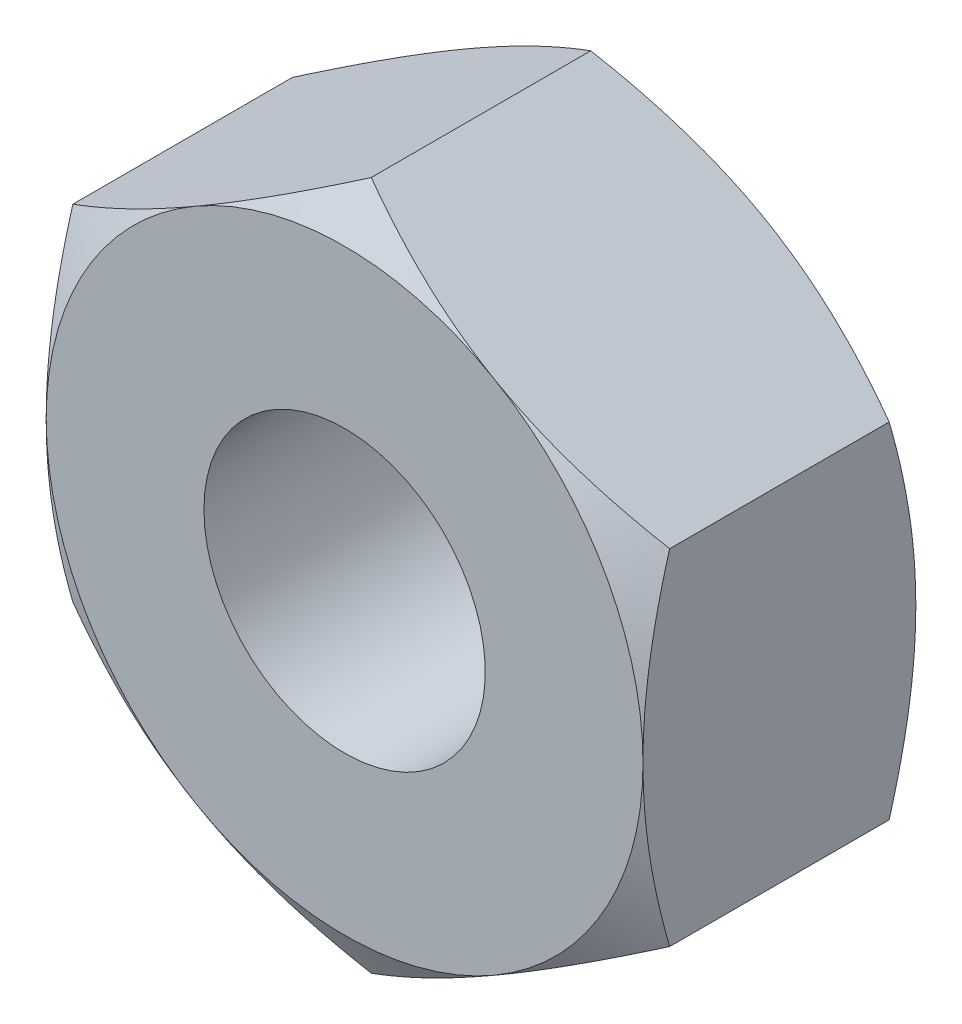
ISO-10303-21;
HEADER;
FILE_DESCRIPTION(('STEP AP214'),'2;1');
FILE_NAME('part.step','',(''),(''),'','','');
FILE_SCHEMA(('AUTOMOTIVE_DESIGN { 1 0 10303 214 1 1 1 1 }'));
ENDSEC;
DATA;
#1=APPLICATION_CONTEXT('core data for automotive mechanical design processes');
#2=APPLICATION_PROTOCOL_DEFINITION('international standard','automotive_design',2000,#1);
#3=PRODUCT_CONTEXT('',#1,'mechanical');
#4=PRODUCT('Part','Part','',(#3));
#5=PRODUCT_RELATED_PRODUCT_CATEGORY('part','',(#4));
#6=PRODUCT_DEFINITION_FORMATION('','',#4);
#7=PRODUCT_DEFINITION_CONTEXT('part definition',#1,'design');
#8=PRODUCT_DEFINITION('design','',#6,#7);
#9=PRODUCT_DEFINITION_SHAPE('','',#8);
#10=(LENGTH_UNIT() NAMED_UNIT(*) SI_UNIT(.MILLI.,.METRE.));
#11=(NAMED_UNIT(*) PLANE_ANGLE_UNIT() SI_UNIT($,.RADIAN.));
#12=(NAMED_UNIT(*) SI_UNIT($,.STERADIAN.) SOLID_ANGLE_UNIT());
#13=UNCERTAINTY_MEASURE_WITH_UNIT(LENGTH_MEASURE(1.E-05),#10,'distance_accuracy_value','');
#14=(GEOMETRIC_REPRESENTATION_CONTEXT(3) GLOBAL_UNCERTAINTY_ASSIGNED_CONTEXT((#13)) GLOBAL_UNIT_ASSIGNED_CONTEXT((#10,
#11,#12)) REPRESENTATION_CONTEXT('',''));
#15=CARTESIAN_POINT('',(0.,0.,0.));
#16=DIRECTION('',(0.,0.,1.));
#17=DIRECTION('',(1.,0.,0.));
#18=AXIS2_PLACEMENT_3D('',#15,#16,#17);
#19=CARTESIAN_POINT('',(-3.5,6.06217782649107,0.));
#20=DIRECTION('',(0.,0.,-1.));
#21=DIRECTION('',(-1.,0.,0.));
#22=AXIS2_PLACEMENT_3D('',#19,#20,#21);
#23=PLANE('',#22);
#24=CARTESIAN_POINT('',(0.,0.,0.));
#25=DIRECTION('',(0.,0.,-1.));
#26=DIRECTION('',(-1.,0.,0.));
#27=AXIS2_PLACEMENT_3D('',#24,#25,#26);
#28=CIRCLE('',#27,1.65);
#29=CARTESIAN_POINT('',(-1.65,0.,0.));
#30=VERTEX_POINT('',#29);
#31=EDGE_CURVE('E334',#30,#30,#28,.T.);
#32=ORIENTED_EDGE('',*,*,#31,.T.);
#33=EDGE_LOOP('',(#32));
#34=FACE_BOUND('',#33,.T.);
#35=CARTESIAN_POINT('',(0.,0.,0.));
#36=DIRECTION('',(0.,0.,-1.));
#37=DIRECTION('',(-1.,0.,0.));
#38=AXIS2_PLACEMENT_3D('',#35,#36,#37);
#39=CIRCLE('',#38,3.5);
#40=CARTESIAN_POINT('',(-3.5,0.,0.));
#41=VERTEX_POINT('',#40);
#42=CARTESIAN_POINT('',(-1.75,3.03108891324554,0.));
#43=VERTEX_POINT('',#42);
#44=EDGE_CURVE('E339',#41,#43,#39,.T.);
#45=ORIENTED_EDGE('',*,*,#44,.F.);
#46=CARTESIAN_POINT('',(0.,0.,0.));
#47=DIRECTION('',(0.,0.,-1.));
#48=DIRECTION('',(-1.,0.,0.));
#49=AXIS2_PLACEMENT_3D('',#46,#47,#48);
#50=CIRCLE('',#49,3.5);
#51=CARTESIAN_POINT('',(-1.75,-3.03108891324554,0.));
#52=VERTEX_POINT('',#51);
#53=EDGE_CURVE('E151',#41,#52,#50,.F.);
#54=ORIENTED_EDGE('',*,*,#53,.T.);
#55=CARTESIAN_POINT('',(1.75,-3.03108891324554,0.));
#56=VERTEX_POINT('',#55);
#57=EDGE_CURVE('E261',#52,#56,#50,.F.);
#58=ORIENTED_EDGE('',*,*,#57,.T.);
#59=CARTESIAN_POINT('',(3.5,0.,0.));
#60=VERTEX_POINT('',#59);
#61=EDGE_CURVE('E154',#56,#60,#50,.F.);
#62=ORIENTED_EDGE('',*,*,#61,.T.);
#63=CARTESIAN_POINT('',(1.75,3.03108891324554,0.));
#64=VERTEX_POINT('',#63);
#65=EDGE_CURVE('E129',#60,#64,#50,.F.);
#66=ORIENTED_EDGE('',*,*,#65,.T.);
#67=EDGE_CURVE('E142',#64,#43,#50,.F.);
#68=ORIENTED_EDGE('',*,*,#67,.T.);
#69=EDGE_LOOP('',(#45,#54,#58,#62,#66,#68));
#70=FACE_BOUND('',#69,.T.);
#71=ADVANCED_FACE('F34',(#34,#70),#23,.F.);
#72=CARTESIAN_POINT('',(0.,0.,0.));
#73=DIRECTION('',(0.,0.,-1.));
#74=DIRECTION('',(-1.,0.,0.));
#75=AXIS2_PLACEMENT_3D('',#72,#73,#74);
#76=CONICAL_SURFACE('',#75,3.5,1.0471975511966);
#77=CARTESIAN_POINT('',(-3.5,-5.53989236245442,-1.76258862699302));
#78=CARTESIAN_POINT('',(-3.5,-5.3860532165401,-1.68751948433659));
#79=CARTESIAN_POINT('',(-3.5,-5.23187272902723,-1.61313843809393));
#80=CARTESIAN_POINT('',(-3.5,-4.92264796176821,-1.46613741238319));
#81=CARTESIAN_POINT('',(-3.5,-4.76760355991844,-1.39351769004126));
#82=CARTESIAN_POINT('',(-3.5,-4.45572331000538,-1.25008237142949));
#83=CARTESIAN_POINT('',(-3.5,-4.29888236123843,-1.17927782946547));
#84=CARTESIAN_POINT('',(-3.5,-3.98399160702081,-1.04042037155886));
#85=CARTESIAN_POINT('',(-3.5,-3.82594185594121,-0.972367332711105));
#86=CARTESIAN_POINT('',(-3.5,-3.50286160109159,-0.837429794505322));
#87=CARTESIAN_POINT('',(-3.5,-3.33777947902079,-0.770668239034199));
#88=CARTESIAN_POINT('',(-3.5,-3.00572557130883,-0.64193208032662));
#89=CARTESIAN_POINT('',(-3.5,-2.83875358212477,-0.579957998446146));
#90=CARTESIAN_POINT('',(-3.5,-2.50293236480576,-0.462342297717918));
#91=CARTESIAN_POINT('',(-3.5,-2.33408734965369,-0.40668876556195));
#92=CARTESIAN_POINT('',(-3.5,-1.99397751409095,-0.303425599123454));
#93=CARTESIAN_POINT('',(-3.5,-1.82271343808269,-0.255813546307966));
#94=CARTESIAN_POINT('',(-3.5,-1.4786457519878,-0.171103820198957));
#95=CARTESIAN_POINT('',(-3.5,-1.30585748565603,-0.133944937877304));
#96=CARTESIAN_POINT('',(-3.5,-0.958019268778114,-0.072156902579753));
#97=CARTESIAN_POINT('',(-3.5,-0.782969565466401,-0.0475263916135297));
#98=CARTESIAN_POINT('',(-3.5,-0.433812660003266,-0.0130761777677311));
#99=CARTESIAN_POINT('',(-3.5,-0.259725587572326,-0.0030575057037546));
#100=CARTESIAN_POINT('',(-3.5,0.0886801026342236,0.00185116562641155));
#101=CARTESIAN_POINT('',(-3.5,0.262998720999756,-0.00325887372577282));
#102=CARTESIAN_POINT('',(-3.5,0.555719576291214,-0.0241715304434397));
#103=CARTESIAN_POINT('',(-3.5,0.674418621972378,-0.0360937635824105));
#104=CARTESIAN_POINT('',(-3.5,0.911014523435454,-0.0662689497923993));
#105=CARTESIAN_POINT('',(-3.5,1.02891127986753,-0.0845226728711187));
#106=CARTESIAN_POINT('',(-3.5,1.38120423516554,-0.147828619091112));
#107=CARTESIAN_POINT('',(-3.5,1.6140874340769,-0.201416195795398));
#108=CARTESIAN_POINT('',(-3.5,1.96246692726668,-0.295188199848335));
#109=CARTESIAN_POINT('',(-3.5,2.07974536032544,-0.329136613349014));
#110=CARTESIAN_POINT('',(-3.5,2.31316562457128,-0.400772835707282));
#111=CARTESIAN_POINT('',(-3.5,2.42930744737274,-0.438460672130622));
#112=CARTESIAN_POINT('',(-3.5,2.66048730435562,-0.516953480503659));
#113=CARTESIAN_POINT('',(-3.5,2.77552563429878,-0.557757589363847));
#114=CARTESIAN_POINT('',(-3.5,3.00463505031464,-0.641981788444827));
#115=CARTESIAN_POINT('',(-3.5,3.11870615438962,-0.685401829854666));
#116=CARTESIAN_POINT('',(-3.5,3.41088605733785,-0.799847325512538));
#117=CARTESIAN_POINT('',(-3.5,3.58836543114828,-0.872477730631522));
#118=CARTESIAN_POINT('',(-3.5,3.9415935226893,-1.02184558996144));
#119=CARTESIAN_POINT('',(-3.5,4.11734207697922,-1.09858342771535));
#120=CARTESIAN_POINT('',(-3.5,4.46747042115829,-1.25524955587583));
#121=CARTESIAN_POINT('',(-3.5,4.64184978310643,-1.33517879969863));
#122=CARTESIAN_POINT('',(-3.5,4.98945002227182,-1.49752225634927));
#123=CARTESIAN_POINT('',(-3.5,5.16267086647972,-1.57993653961731));
#124=CARTESIAN_POINT('',(-3.5,5.68141043626017,-1.83034120184867));
#125=CARTESIAN_POINT('',(-3.5,6.02551030979994,-2.00126768625815));
#126=CARTESIAN_POINT('',(-3.5,6.71106540957773,-2.348155651419));
#127=CARTESIAN_POINT('',(-3.5,7.05252109974023,-2.52411622228031));
#128=CARTESIAN_POINT('',(-3.5,7.70032644575751,-2.86216222693846));
#129=CARTESIAN_POINT('',(-3.5,8.00684578413751,-3.02392309391563));
#130=CARTESIAN_POINT('',(-3.5,8.61878605977356,-3.34954435591343));
#131=CARTESIAN_POINT('',(-3.5,8.92420693825149,-3.51340486120564));
#132=CARTESIAN_POINT('',(-3.5,9.53323628444417,-3.84217810932372));
#133=CARTESIAN_POINT('',(-3.5,9.836847429965,-4.00708589795973));
#134=CARTESIAN_POINT('',(-3.5,10.4433788355129,-4.33811602115841));
#135=CARTESIAN_POINT('',(-3.5,10.746299143654,-4.50423826752546));
#136=CARTESIAN_POINT('',(-3.5,11.0489725598003,-4.67080588613037));
#137=B_SPLINE_CURVE_WITH_KNOTS('',3,(#77,#78,#79,#80,#81,#82,#83,#84,#85,#86,#87,#88,#89,#90,
#91,#92,#93,#94,#95,#96,#97,#98,#99,#100,#101,#102,#103,#104,#105,#106,#107,#108,#109,#110,#111,
#112,#113,#114,#115,#116,#117,#118,#119,#120,#121,#122,#123,#124,#125,#126,#127,#128,#129,#130,
#131,#132,#133,#134,#135,#136),.UNSPECIFIED.,.F.,.F.,(4,2,2,2,2,2,2,2,2,2,2,2,2,2,2,2,2,2,2,2,2,
2,2,2,2,2,2,2,2,4),(0.,0.513539328282993,1.02715317957733,1.5433792784945,2.0595822928989,
2.59373725932003,3.12795031346599,3.6611391300389,4.19416729956026,4.72400604904392,
5.25378735536234,5.77628502038714,6.29878401916913,6.65650136748778,7.01426223506461,
7.73013057854358,8.09637575435708,8.46262363020592,8.82877043457395,9.19491040908602,
9.77013340053384,10.3454101990572,10.9208601636723,11.4963264551835,12.6488931115807,
13.8012527463613,14.840994652675,15.8807913911788,16.9173059219799,17.9537459129334),.UNSPECIFIED.);
#138=CARTESIAN_POINT('',(-3.5,2.0207259421637,-0.312607391169641));
#139=VERTEX_POINT('',#138);
#140=EDGE_CURVE('E159',#139,#41,#137,.F.);
#141=ORIENTED_EDGE('',*,*,#140,.T.);
#142=ORIENTED_EDGE('',*,*,#44,.T.);
#143=CARTESIAN_POINT('',(0.000199999999999895,4.04156735438122,-0.312674060693368));
#144=CARTESIAN_POINT('',(-0.15360717845245,3.9527667384984,-0.261385788989982));
#145=CARTESIAN_POINT('',(-0.308742010834424,3.86319960126198,-0.214740953816196));
#146=CARTESIAN_POINT('',(-0.621698006576781,3.68251437287563,-0.133321875533349));
#147=CARTESIAN_POINT('',(-0.779524730787496,3.59139307116725,-0.0985764355845621));
#148=CARTESIAN_POINT('',(-1.09322221038013,3.41027974688034,-0.0444900271828375));
#149=CARTESIAN_POINT('',(-1.24904469916069,3.32031559103708,-0.0247890862603831));
#150=CARTESIAN_POINT('',(-1.56142288720537,3.13996396008052,-0.0012701327372561));
#151=CARTESIAN_POINT('',(-1.71797745103423,3.04957714051106,0.00256735545443301));
#152=CARTESIAN_POINT('',(-2.01050921992099,2.88068384499778,-0.00541530187697962));
#153=CARTESIAN_POINT('',(-2.14653021245791,2.80215208834115,-0.0152754340696092));
#154=CARTESIAN_POINT('',(-2.41768602028899,2.64560020969754,-0.0465264668994052));
#155=CARTESIAN_POINT('',(-2.55281989768468,2.5675806292065,-0.0679280432857994));
#156=CARTESIAN_POINT('',(-2.82453479240518,2.41070596159679,-0.121430407880577));
#157=CARTESIAN_POINT('',(-2.96108141927834,2.33187072981464,-0.153757994445087));
#158=CARTESIAN_POINT('',(-3.2321380929445,2.17537608630784,-0.227128933807993));
#159=CARTESIAN_POINT('',(-3.36665161246854,2.09771466960099,-0.268155046569865));
#160=CARTESIAN_POINT('',(-3.5002,2.02061047210986,-0.312674060693369));
#161=B_SPLINE_CURVE_WITH_KNOTS('',3,(#143,#144,#145,#146,#147,#148,#149,#150,#151,#152,#153,
#154,#155,#156,#157,#158,#159,#160),.UNSPECIFIED.,.F.,.F.,(4,2,2,2,2,2,2,2,4),(0.,
0.554793832886253,1.11092123814984,1.65328467083219,2.19498204478403,2.6666513085086,
3.13875761298267,3.62133612600509,4.10296698719187),.UNSPECIFIED.);
#162=EDGE_CURVE('E194',#43,#139,#161,.T.);
#163=ORIENTED_EDGE('',*,*,#162,.T.);
#164=EDGE_LOOP('',(#141,#142,#163));
#165=FACE_BOUND('',#164,.T.);
#166=ADVANCED_FACE('F181',(#165),#76,.T.);
#167=CARTESIAN_POINT('',(3.5002,2.02061047210986,-0.312674060693369));
#168=CARTESIAN_POINT('',(3.34639282154755,2.10941108799268,-0.261385788989982));
#169=CARTESIAN_POINT('',(3.19125798916558,2.1989782252291,-0.214740953816196));
#170=CARTESIAN_POINT('',(2.87830199342322,2.37966345361545,-0.133321875533349));
#171=CARTESIAN_POINT('',(2.7204752692125,2.47078475532383,-0.0985764355845622));
#172=CARTESIAN_POINT('',(2.40677778961987,2.65189807961074,-0.0444900271828376));
#173=CARTESIAN_POINT('',(2.25095530083931,2.741862235454,-0.0247890862603834));
#174=CARTESIAN_POINT('',(1.93857711279463,2.92221386641056,-0.00127013273725651));
#175=CARTESIAN_POINT('',(1.78202254896577,3.01260068598002,0.00256735545443263));
#176=CARTESIAN_POINT('',(1.48949078007901,3.1814939814933,-0.00541530187697965));
#177=CARTESIAN_POINT('',(1.35346978754209,3.26002573814993,-0.0152754340696089));
#178=CARTESIAN_POINT('',(1.08231397971101,3.41657761679354,-0.0465264668994049));
#179=CARTESIAN_POINT('',(0.947180102315318,3.49459719728458,-0.0679280432857991));
#180=CARTESIAN_POINT('',(0.675465207594817,3.65147186489429,-0.121430407880577));
#181=CARTESIAN_POINT('',(0.538918580721665,3.73030709667644,-0.153757994445087));
#182=CARTESIAN_POINT('',(0.267861907055499,3.88680174018325,-0.227128933807993));
#183=CARTESIAN_POINT('',(0.133348387531464,3.96446315689009,-0.268155046569865));
#184=CARTESIAN_POINT('',(-0.000199999999999767,4.04156735438122,-0.312674060693368));
#185=B_SPLINE_CURVE_WITH_KNOTS('',3,(#167,#168,#169,#170,#171,#172,#173,#174,#175,#176,#177,
#178,#179,#180,#181,#182,#183,#184),.UNSPECIFIED.,.F.,.F.,(4,2,2,2,2,2,2,2,4),(0.,
0.554793832886253,1.11092123814984,1.65328467083219,2.19498204478403,2.6666513085086,
3.13875761298267,3.62133612600509,4.10296698719187),.UNSPECIFIED.);
#186=CARTESIAN_POINT('',(0.,4.04145188432738,-0.312607391169641));
#187=VERTEX_POINT('',#186);
#188=EDGE_CURVE('E138',#64,#187,#185,.T.);
#189=ORIENTED_EDGE('',*,*,#188,.T.);
#190=EDGE_CURVE('E145',#187,#43,#161,.T.);
#191=ORIENTED_EDGE('',*,*,#190,.T.);
#192=ORIENTED_EDGE('',*,*,#67,.F.);
#193=EDGE_LOOP('',(#189,#191,#192));
#194=FACE_BOUND('',#193,.T.);
#195=ADVANCED_FACE('F143',(#194),#76,.T.);
#196=CARTESIAN_POINT('',(3.5,-5.53989236245442,-1.76258862699302));
#197=CARTESIAN_POINT('',(3.5,-5.3860532165401,-1.68751948433659));
#198=CARTESIAN_POINT('',(3.5,-5.23187272902723,-1.61313843809393));
#199=CARTESIAN_POINT('',(3.5,-4.92264796176821,-1.46613741238319));
#200=CARTESIAN_POINT('',(3.5,-4.76760355991844,-1.39351769004126));
#201=CARTESIAN_POINT('',(3.5,-4.45572331000538,-1.25008237142949));
#202=CARTESIAN_POINT('',(3.5,-4.29888236123843,-1.17927782946547));
#203=CARTESIAN_POINT('',(3.5,-3.98399160702081,-1.04042037155886));
#204=CARTESIAN_POINT('',(3.5,-3.82594185594121,-0.972367332711105));
#205=CARTESIAN_POINT('',(3.5,-3.50286160109159,-0.837429794505322));
#206=CARTESIAN_POINT('',(3.5,-3.33777947902079,-0.770668239034199));
#207=CARTESIAN_POINT('',(3.5,-3.00572557130883,-0.64193208032662));
#208=CARTESIAN_POINT('',(3.5,-2.83875358212477,-0.579957998446146));
#209=CARTESIAN_POINT('',(3.5,-2.50293236480576,-0.462342297717918));
#210=CARTESIAN_POINT('',(3.5,-2.33408734965369,-0.40668876556195));
#211=CARTESIAN_POINT('',(3.5,-1.99397751409095,-0.303425599123454));
#212=CARTESIAN_POINT('',(3.5,-1.82271343808269,-0.255813546307966));
#213=CARTESIAN_POINT('',(3.5,-1.4786457519878,-0.171103820198957));
#214=CARTESIAN_POINT('',(3.5,-1.30585748565603,-0.133944937877304));
#215=CARTESIAN_POINT('',(3.5,-0.958019268778114,-0.072156902579753));
#216=CARTESIAN_POINT('',(3.5,-0.782969565466401,-0.0475263916135297));
#217=CARTESIAN_POINT('',(3.5,-0.433812660003266,-0.0130761777677311));
#218=CARTESIAN_POINT('',(3.5,-0.259725587572326,-0.0030575057037546));
#219=CARTESIAN_POINT('',(3.5,0.0886801026342236,0.00185116562641155));
#220=CARTESIAN_POINT('',(3.5,0.262998720999756,-0.00325887372577282));
#221=CARTESIAN_POINT('',(3.5,0.555719576291214,-0.0241715304434397));
#222=CARTESIAN_POINT('',(3.5,0.674418621972378,-0.0360937635824105));
#223=CARTESIAN_POINT('',(3.5,0.911014523435454,-0.0662689497923993));
#224=CARTESIAN_POINT('',(3.5,1.02891127986753,-0.0845226728711187));
#225=CARTESIAN_POINT('',(3.5,1.38120423516554,-0.147828619091112));
#226=CARTESIAN_POINT('',(3.5,1.6140874340769,-0.201416195795398));
#227=CARTESIAN_POINT('',(3.5,1.96246692726668,-0.295188199848335));
#228=CARTESIAN_POINT('',(3.5,2.07974536032544,-0.329136613349014));
#229=CARTESIAN_POINT('',(3.5,2.31316562457128,-0.400772835707282));
#230=CARTESIAN_POINT('',(3.5,2.42930744737274,-0.438460672130622));
#231=CARTESIAN_POINT('',(3.5,2.66048730435562,-0.516953480503659));
#232=CARTESIAN_POINT('',(3.5,2.77552563429878,-0.557757589363847));
#233=CARTESIAN_POINT('',(3.5,3.00463505031464,-0.641981788444827));
#234=CARTESIAN_POINT('',(3.5,3.11870615438962,-0.685401829854666));
#235=CARTESIAN_POINT('',(3.5,3.41088605733785,-0.799847325512538));
#236=CARTESIAN_POINT('',(3.5,3.58836543114828,-0.872477730631522));
#237=CARTESIAN_POINT('',(3.5,3.9415935226893,-1.02184558996144));
#238=CARTESIAN_POINT('',(3.5,4.11734207697922,-1.09858342771535));
#239=CARTESIAN_POINT('',(3.5,4.46747042115829,-1.25524955587583));
#240=CARTESIAN_POINT('',(3.5,4.64184978310643,-1.33517879969863));
#241=CARTESIAN_POINT('',(3.5,4.98945002227182,-1.49752225634927));
#242=CARTESIAN_POINT('',(3.5,5.16267086647972,-1.57993653961731));
#243=CARTESIAN_POINT('',(3.5,5.68141043626017,-1.83034120184867));
#244=CARTESIAN_POINT('',(3.5,6.02551030979994,-2.00126768625815));
#245=CARTESIAN_POINT('',(3.5,6.71106540957773,-2.348155651419));
#246=CARTESIAN_POINT('',(3.5,7.05252109974023,-2.52411622228031));
#247=CARTESIAN_POINT('',(3.5,7.70032644575751,-2.86216222693846));
#248=CARTESIAN_POINT('',(3.5,8.00684578413751,-3.02392309391563));
#249=CARTESIAN_POINT('',(3.5,8.61878605977356,-3.34954435591343));
#250=CARTESIAN_POINT('',(3.5,8.92420693825149,-3.51340486120564));
#251=CARTESIAN_POINT('',(3.5,9.53323628444417,-3.84217810932372));
#252=CARTESIAN_POINT('',(3.5,9.836847429965,-4.00708589795973));
#253=CARTESIAN_POINT('',(3.5,10.4433788355129,-4.33811602115841));
#254=CARTESIAN_POINT('',(3.5,10.746299143654,-4.50423826752546));
#255=CARTESIAN_POINT('',(3.5,11.0489725598003,-4.67080588613037));
#256=B_SPLINE_CURVE_WITH_KNOTS('',3,(#196,#197,#198,#199,#200,#201,#202,#203,#204,#205,#206,
#207,#208,#209,#210,#211,#212,#213,#214,#215,#216,#217,#218,#219,#220,#221,#222,#223,#224,#225,
#226,#227,#228,#229,#230,#231,#232,#233,#234,#235,#236,#237,#238,#239,#240,#241,#242,#243,#244,
#245,#246,#247,#248,#249,#250,#251,#252,#253,#254,#255),.UNSPECIFIED.,.F.,.F.,(4,2,2,2,2,2,2,2,
2,2,2,2,2,2,2,2,2,2,2,2,2,2,2,2,2,2,2,2,2,4),(0.,0.513539328282993,1.02715317957733,
1.5433792784945,2.0595822928989,2.59373725932003,3.12795031346599,3.6611391300389,
4.19416729956026,4.72400604904392,5.25378735536234,5.77628502038714,6.29878401916913,
6.65650136748778,7.01426223506461,7.73013057854358,8.09637575435708,8.46262363020592,
8.82877043457395,9.19491040908602,9.77013340053384,10.3454101990572,10.9208601636723,
11.4963264551835,12.6488931115807,13.8012527463613,14.840994652675,15.8807913911788,
16.9173059219799,17.9537459129334),.UNSPECIFIED.);
#257=CARTESIAN_POINT('',(3.5,2.0207259421637,-0.312607391169641));
#258=VERTEX_POINT('',#257);
#259=EDGE_CURVE('E132',#60,#258,#256,.T.);
#260=ORIENTED_EDGE('',*,*,#259,.T.);
#261=EDGE_CURVE('E125',#258,#64,#185,.T.);
#262=ORIENTED_EDGE('',*,*,#261,.T.);
#263=ORIENTED_EDGE('',*,*,#65,.F.);
#264=EDGE_LOOP('',(#260,#262,#263));
#265=FACE_BOUND('',#264,.T.);
#266=ADVANCED_FACE('F127',(#265),#76,.T.);
#267=CARTESIAN_POINT('',(-0.000199999999999895,-4.04156735438122,-0.312674060693368));
#268=CARTESIAN_POINT('',(0.15360717845245,-3.9527667384984,-0.261385788989982));
#269=CARTESIAN_POINT('',(0.308742010834424,-3.86319960126198,-0.214740953816196));
#270=CARTESIAN_POINT('',(0.621698006576781,-3.68251437287563,-0.133321875533349));
#271=CARTESIAN_POINT('',(0.779524730787496,-3.59139307116725,-0.0985764355845621));
#272=CARTESIAN_POINT('',(1.09322221038013,-3.41027974688034,-0.0444900271828375));
#273=CARTESIAN_POINT('',(1.24904469916069,-3.32031559103708,-0.0247890862603831));
#274=CARTESIAN_POINT('',(1.56142288720537,-3.13996396008052,-0.0012701327372561));
#275=CARTESIAN_POINT('',(1.71797745103423,-3.04957714051106,0.00256735545443301));
#276=CARTESIAN_POINT('',(2.01050921992099,-2.88068384499778,-0.00541530187697962));
#277=CARTESIAN_POINT('',(2.14653021245791,-2.80215208834115,-0.0152754340696092));
#278=CARTESIAN_POINT('',(2.41768602028899,-2.64560020969754,-0.0465264668994052));
#279=CARTESIAN_POINT('',(2.55281989768468,-2.5675806292065,-0.0679280432857994));
#280=CARTESIAN_POINT('',(2.82453479240518,-2.41070596159679,-0.121430407880577));
#281=CARTESIAN_POINT('',(2.96108141927834,-2.33187072981464,-0.153757994445087));
#282=CARTESIAN_POINT('',(3.2321380929445,-2.17537608630784,-0.227128933807993));
#283=CARTESIAN_POINT('',(3.36665161246854,-2.09771466960099,-0.268155046569865));
#284=CARTESIAN_POINT('',(3.5002,-2.02061047210986,-0.312674060693369));
#285=B_SPLINE_CURVE_WITH_KNOTS('',3,(#267,#268,#269,#270,#271,#272,#273,#274,#275,#276,#277,
#278,#279,#280,#281,#282,#283,#284),.UNSPECIFIED.,.F.,.F.,(4,2,2,2,2,2,2,2,4),(0.,
0.554793832886253,1.11092123814984,1.65328467083219,2.19498204478403,2.6666513085086,
3.13875761298267,3.62133612600509,4.10296698719187),.UNSPECIFIED.);
#286=CARTESIAN_POINT('',(3.5,-2.0207259421638,-0.312607391169573));
#287=VERTEX_POINT('',#286);
#288=EDGE_CURVE('E210',#56,#287,#285,.T.);
#289=ORIENTED_EDGE('',*,*,#288,.T.);
#290=EDGE_CURVE('E209',#287,#60,#256,.T.);
#291=ORIENTED_EDGE('',*,*,#290,.T.);
#292=ORIENTED_EDGE('',*,*,#61,.F.);
#293=EDGE_LOOP('',(#289,#291,#292));
#294=FACE_BOUND('',#293,.T.);
#295=ADVANCED_FACE('F442',(#294),#76,.T.);
#296=CARTESIAN_POINT('',(0.,-4.04145188432738,-0.312607391169641));
#297=VERTEX_POINT('',#296);
#298=EDGE_CURVE('E271',#297,#56,#285,.T.);
#299=ORIENTED_EDGE('',*,*,#298,.T.);
#300=ORIENTED_EDGE('',*,*,#57,.F.);
#301=CARTESIAN_POINT('',(-3.5002,-2.02061047210986,-0.312674060693369));
#302=CARTESIAN_POINT('',(-3.34639282154755,-2.10941108799268,-0.261385788989982));
#303=CARTESIAN_POINT('',(-3.19125798916558,-2.1989782252291,-0.214740953816196));
#304=CARTESIAN_POINT('',(-2.87830199342322,-2.37966345361545,-0.133321875533349));
#305=CARTESIAN_POINT('',(-2.7204752692125,-2.47078475532383,-0.0985764355845622));
#306=CARTESIAN_POINT('',(-2.40677778961987,-2.65189807961074,-0.0444900271828376));
#307=CARTESIAN_POINT('',(-2.25095530083931,-2.741862235454,-0.0247890862603834));
#308=CARTESIAN_POINT('',(-1.93857711279463,-2.92221386641056,-0.00127013273725651));
#309=CARTESIAN_POINT('',(-1.78202254896577,-3.01260068598002,0.00256735545443263));
#310=CARTESIAN_POINT('',(-1.48949078007901,-3.1814939814933,-0.00541530187697965));
#311=CARTESIAN_POINT('',(-1.35346978754209,-3.26002573814993,-0.0152754340696089));
#312=CARTESIAN_POINT('',(-1.08231397971101,-3.41657761679354,-0.0465264668994049));
#313=CARTESIAN_POINT('',(-0.947180102315318,-3.49459719728458,-0.0679280432857991));
#314=CARTESIAN_POINT('',(-0.675465207594817,-3.65147186489429,-0.121430407880577));
#315=CARTESIAN_POINT('',(-0.538918580721665,-3.73030709667644,-0.153757994445087));
#316=CARTESIAN_POINT('',(-0.267861907055499,-3.88680174018325,-0.227128933807993));
#317=CARTESIAN_POINT('',(-0.133348387531464,-3.96446315689009,-0.268155046569865));
#318=CARTESIAN_POINT('',(0.000199999999999767,-4.04156735438122,-0.312674060693368));
#319=B_SPLINE_CURVE_WITH_KNOTS('',3,(#301,#302,#303,#304,#305,#306,#307,#308,#309,#310,#311,
#312,#313,#314,#315,#316,#317,#318),.UNSPECIFIED.,.F.,.F.,(4,2,2,2,2,2,2,2,4),(0.,
0.554793832886253,1.11092123814984,1.65328467083219,2.19498204478403,2.6666513085086,
3.13875761298267,3.62133612600509,4.10296698719187),.UNSPECIFIED.);
#320=EDGE_CURVE('E275',#52,#297,#319,.T.);
#321=ORIENTED_EDGE('',*,*,#320,.T.);
#322=EDGE_LOOP('',(#299,#300,#321));
#323=FACE_BOUND('',#322,.T.);
#324=ADVANCED_FACE('F187',(#323),#76,.T.);
#325=CARTESIAN_POINT('',(-3.5,-2.0207259421638,-0.312607391169573));
#326=VERTEX_POINT('',#325);
#327=EDGE_CURVE('E174',#326,#52,#319,.T.);
#328=ORIENTED_EDGE('',*,*,#327,.T.);
#329=ORIENTED_EDGE('',*,*,#53,.F.);
#330=EDGE_CURVE('E137',#41,#326,#137,.F.);
#331=ORIENTED_EDGE('',*,*,#330,.T.);
#332=EDGE_LOOP('',(#328,#329,#331));
#333=FACE_BOUND('',#332,.T.);
#334=ADVANCED_FACE('F280',(#333),#76,.T.);
#335=CARTESIAN_POINT('',(3.5,2.0207259421637,-3.2));
#336=DIRECTION('',(0.499999999999999,0.866025403784439,0.));
#337=DIRECTION('',(-0.866025403784439,0.499999999999999,0.));
#338=AXIS2_PLACEMENT_3D('',#335,#336,#337);
#339=PLANE('',#338);
#340=CARTESIAN_POINT('',(-0.0002,4.04156735438122,-2.88732593930663));
#341=CARTESIAN_POINT('',(0.15360717845245,3.9527667384984,-2.93861421101002));
#342=CARTESIAN_POINT('',(0.308742010834424,3.86319960126198,-2.9852590461838));
#343=CARTESIAN_POINT('',(0.621698006576782,3.68251437287563,-3.06667812446665));
#344=CARTESIAN_POINT('',(0.779524730787496,3.59139307116725,-3.10142356441544));
#345=CARTESIAN_POINT('',(1.09322221038013,3.41027974688034,-3.15550997281716));
#346=CARTESIAN_POINT('',(1.24904469916069,3.32031559103708,-3.17521091373962));
#347=CARTESIAN_POINT('',(1.56142288720537,3.13996396008052,-3.19872986726274));
#348=CARTESIAN_POINT('',(1.71797745103423,3.04957714051107,-3.20256735545443));
#349=CARTESIAN_POINT('',(2.01050921992099,2.88068384499778,-3.19458469812302));
#350=CARTESIAN_POINT('',(2.14653021245791,2.80215208834115,-3.18472456593039));
#351=CARTESIAN_POINT('',(2.417686020289,2.64560020969754,-3.1534735331006));
#352=CARTESIAN_POINT('',(2.55281989768468,2.5675806292065,-3.1320719567142));
#353=CARTESIAN_POINT('',(2.82453479240518,2.41070596159679,-3.07856959211942));
#354=CARTESIAN_POINT('',(2.96108141927834,2.33187072981464,-3.04624200555491));
#355=CARTESIAN_POINT('',(3.2321380929445,2.17537608630784,-2.97287106619201));
#356=CARTESIAN_POINT('',(3.36665161246854,2.09771466960099,-2.93184495343014));
#357=CARTESIAN_POINT('',(3.5002,2.02061047210986,-2.88732593930663));
#358=B_SPLINE_CURVE_WITH_KNOTS('',3,(#340,#341,#342,#343,#344,#345,#346,#347,#348,#349,#350,
#351,#352,#353,#354,#355,#356,#357),.UNSPECIFIED.,.F.,.F.,(4,2,2,2,2,2,2,2,4),(0.,
0.554793832886253,1.11092123814984,1.65328467083218,2.19498204478403,2.6666513085086,
3.13875761298267,3.62133612600509,4.10296698719187),.UNSPECIFIED.);
#359=CARTESIAN_POINT('',(0.,4.04145188432738,-2.88739260883036));
#360=VERTEX_POINT('',#359);
#361=CARTESIAN_POINT('',(1.75,3.03108891324554,-3.2));
#362=VERTEX_POINT('',#361);
#363=EDGE_CURVE('E246',#360,#362,#358,.T.);
#364=ORIENTED_EDGE('',*,*,#363,.F.);
#365=DIRECTION('',(0.,0.,1.));
#366=VECTOR('',#365,1.);
#367=CARTESIAN_POINT('',(0.,4.04145188432738,-3.2));
#368=LINE('',#367,#366);
#369=EDGE_CURVE('E158',#360,#187,#368,.T.);
#370=ORIENTED_EDGE('',*,*,#369,.T.);
#371=ORIENTED_EDGE('',*,*,#188,.F.);
#372=ORIENTED_EDGE('',*,*,#261,.F.);
#373=DIRECTION('',(0.,0.,1.));
#374=VECTOR('',#373,1.);
#375=CARTESIAN_POINT('',(3.5,2.0207259421637,-3.2));
#376=LINE('',#375,#374);
#377=CARTESIAN_POINT('',(3.5,2.0207259421637,-2.88739260883036));
#378=VERTEX_POINT('',#377);
#379=EDGE_CURVE('E150',#378,#258,#376,.T.);
#380=ORIENTED_EDGE('',*,*,#379,.F.);
#381=EDGE_CURVE('E240',#362,#378,#358,.T.);
#382=ORIENTED_EDGE('',*,*,#381,.F.);
#383=EDGE_LOOP('',(#364,#370,#371,#372,#380,#382));
#384=FACE_BOUND('',#383,.T.);
#385=ADVANCED_FACE('F36',(#384),#339,.T.);
#386=CARTESIAN_POINT('',(3.5,-2.0207259421637,-3.2));
#387=DIRECTION('',(1.,0.,0.));
#388=DIRECTION('',(0.,0.,-1.));
#389=AXIS2_PLACEMENT_3D('',#386,#387,#388);
#390=PLANE('',#389);
#391=CARTESIAN_POINT('',(3.5,-5.53989236245442,-1.43741137300698));
#392=CARTESIAN_POINT('',(3.5,-5.3860532165401,-1.51248051566341));
#393=CARTESIAN_POINT('',(3.5,-5.23187272902723,-1.58686156190607));
#394=CARTESIAN_POINT('',(3.5,-4.92264796176821,-1.73386258761681));
#395=CARTESIAN_POINT('',(3.5,-4.76760355991844,-1.80648230995874));
#396=CARTESIAN_POINT('',(3.5,-4.45572331000538,-1.94991762857051));
#397=CARTESIAN_POINT('',(3.5,-4.29888236123843,-2.02072217053453));
#398=CARTESIAN_POINT('',(3.5,-3.9839916070208,-2.15957962844114));
#399=CARTESIAN_POINT('',(3.5,-3.82594185594121,-2.2276326672889));
#400=CARTESIAN_POINT('',(3.5,-3.50286160109159,-2.36257020549468));
#401=CARTESIAN_POINT('',(3.5,-3.33777947902078,-2.4293317609658));
#402=CARTESIAN_POINT('',(3.5,-3.00572557130883,-2.55806791967338));
#403=CARTESIAN_POINT('',(3.5,-2.83875358212477,-2.62004200155385));
#404=CARTESIAN_POINT('',(3.5,-2.50293236480576,-2.73765770228208));
#405=CARTESIAN_POINT('',(3.5,-2.33408734965369,-2.79331123443805));
#406=CARTESIAN_POINT('',(3.5,-1.99397751409095,-2.89657440087655));
#407=CARTESIAN_POINT('',(3.5,-1.82271343808269,-2.94418645369203));
#408=CARTESIAN_POINT('',(3.5,-1.4786457519878,-3.02889617980104));
#409=CARTESIAN_POINT('',(3.5,-1.30585748565603,-3.0660550621227));
#410=CARTESIAN_POINT('',(3.5,-0.958019268778115,-3.12784309742025));
#411=CARTESIAN_POINT('',(3.5,-0.782969565466402,-3.15247360838647));
#412=CARTESIAN_POINT('',(3.5,-0.433812660003267,-3.18692382223227));
#413=CARTESIAN_POINT('',(3.5,-0.259725587572327,-3.19694249429625));
#414=CARTESIAN_POINT('',(3.5,0.0886801026342228,-3.20185116562641));
#415=CARTESIAN_POINT('',(3.5,0.262998720999755,-3.19674112627423));
#416=CARTESIAN_POINT('',(3.5,0.555719576291214,-3.17582846955656));
#417=CARTESIAN_POINT('',(3.5,0.674418621972378,-3.16390623641759));
#418=CARTESIAN_POINT('',(3.5,0.911014523435453,-3.1337310502076));
#419=CARTESIAN_POINT('',(3.5,1.02891127986753,-3.11547732712888));
#420=CARTESIAN_POINT('',(3.5,1.38120423516554,-3.05217138090889));
#421=CARTESIAN_POINT('',(3.5,1.6140874340769,-2.9985838042046));
#422=CARTESIAN_POINT('',(3.5,1.96246692726668,-2.90481180015167));
#423=CARTESIAN_POINT('',(3.5,2.07974536032543,-2.87086338665099));
#424=CARTESIAN_POINT('',(3.5,2.31316562457128,-2.79922716429272));
#425=CARTESIAN_POINT('',(3.5,2.42930744737274,-2.76153932786938));
#426=CARTESIAN_POINT('',(3.5,2.66048730435562,-2.68304651949634));
#427=CARTESIAN_POINT('',(3.5,2.77552563429878,-2.64224241063615));
#428=CARTESIAN_POINT('',(3.5,3.00463505031464,-2.55801821155517));
#429=CARTESIAN_POINT('',(3.5,3.11870615438962,-2.51459817014533));
#430=CARTESIAN_POINT('',(3.5,3.41088605733785,-2.40015267448746));
#431=CARTESIAN_POINT('',(3.5,3.58836543114828,-2.32752226936848));
#432=CARTESIAN_POINT('',(3.5,3.94159352268929,-2.17815441003856));
#433=CARTESIAN_POINT('',(3.5,4.11734207697922,-2.10141657228465));
#434=CARTESIAN_POINT('',(3.5,4.46747042115829,-1.94475044412417));
#435=CARTESIAN_POINT('',(3.5,4.64184978310643,-1.86482120030137));
#436=CARTESIAN_POINT('',(3.5,4.98945002227182,-1.70247774365073));
#437=CARTESIAN_POINT('',(3.5,5.16267086647972,-1.62006346038269));
#438=CARTESIAN_POINT('',(3.5,5.68141043626017,-1.36965879815133));
#439=CARTESIAN_POINT('',(3.5,6.02551030979994,-1.19873231374185));
#440=CARTESIAN_POINT('',(3.5,6.71106540957773,-0.851844348580996));
#441=CARTESIAN_POINT('',(3.5,7.05252109974023,-0.675883777719692));
#442=CARTESIAN_POINT('',(3.5,7.70032644575751,-0.337837773061537));
#443=CARTESIAN_POINT('',(3.5,8.00684578413751,-0.176076906084376));
#444=CARTESIAN_POINT('',(3.5,8.61878605977356,0.149544355913433));
#445=CARTESIAN_POINT('',(3.5,8.92420693825149,0.313404861205643));
#446=CARTESIAN_POINT('',(3.5,9.53323628444417,0.642178109323717));
#447=CARTESIAN_POINT('',(3.5,9.836847429965,0.807085897959726));
#448=CARTESIAN_POINT('',(3.5,10.4433788355129,1.13811602115841));
#449=CARTESIAN_POINT('',(3.5,10.746299143654,1.30423826752546));
#450=CARTESIAN_POINT('',(3.5,11.0489725598003,1.47080588613037));
#451=B_SPLINE_CURVE_WITH_KNOTS('',3,(#391,#392,#393,#394,#395,#396,#397,#398,#399,#400,#401,
#402,#403,#404,#405,#406,#407,#408,#409,#410,#411,#412,#413,#414,#415,#416,#417,#418,#419,#420,
#421,#422,#423,#424,#425,#426,#427,#428,#429,#430,#431,#432,#433,#434,#435,#436,#437,#438,#439,
#440,#441,#442,#443,#444,#445,#446,#447,#448,#449,#450),.UNSPECIFIED.,.F.,.F.,(4,2,2,2,2,2,2,2,
2,2,2,2,2,2,2,2,2,2,2,2,2,2,2,2,2,2,2,2,2,4),(0.,0.513539328282993,1.02715317957733,
1.5433792784945,2.0595822928989,2.59373725932003,3.12795031346599,3.6611391300389,
4.19416729956026,4.72400604904392,5.25378735536234,5.77628502038714,6.29878401916912,
6.65650136748778,7.0142622350646,7.73013057854358,8.09637575435708,8.46262363020592,
8.82877043457395,9.19491040908602,9.77013340053384,10.3454101990572,10.9208601636723,
11.4963264551835,12.6488931115807,13.8012527463613,14.840994652675,15.8807913911788,
16.9173059219799,17.9537459129334),.UNSPECIFIED.);
#452=CARTESIAN_POINT('',(3.5,0.,-3.2));
#453=VERTEX_POINT('',#452);
#454=EDGE_CURVE('E233',#378,#453,#451,.F.);
#455=ORIENTED_EDGE('',*,*,#454,.F.);
#456=ORIENTED_EDGE('',*,*,#379,.T.);
#457=ORIENTED_EDGE('',*,*,#259,.F.);
#458=ORIENTED_EDGE('',*,*,#290,.F.);
#459=DIRECTION('',(0.,0.,1.));
#460=VECTOR('',#459,1.);
#461=CARTESIAN_POINT('',(3.5,-2.0207259421637,-3.2));
#462=LINE('',#461,#460);
#463=CARTESIAN_POINT('',(3.5,-2.0207259421637,-2.88739260883036));
#464=VERTEX_POINT('',#463);
#465=EDGE_CURVE('E248',#464,#287,#462,.T.);
#466=ORIENTED_EDGE('',*,*,#465,.F.);
#467=EDGE_CURVE('E226',#453,#464,#451,.F.);
#468=ORIENTED_EDGE('',*,*,#467,.F.);
#469=EDGE_LOOP('',(#455,#456,#457,#458,#466,#468));
#470=FACE_BOUND('',#469,.T.);
#471=ADVANCED_FACE('F217',(#470),#390,.T.);
#472=CARTESIAN_POINT('',(3.5,-2.0207259421637,-3.2));
#473=DIRECTION('',(0.499999999999999,-0.866025403784439,0.));
#474=DIRECTION('',(0.866025403784439,0.499999999999999,0.));
#475=AXIS2_PLACEMENT_3D('',#472,#473,#474);
#476=PLANE('',#475);
#477=CARTESIAN_POINT('',(3.5002,-2.02061047210986,-2.88732593930663));
#478=CARTESIAN_POINT('',(3.34639282154755,-2.10941108799268,-2.93861421101002));
#479=CARTESIAN_POINT('',(3.19125798916558,-2.1989782252291,-2.9852590461838));
#480=CARTESIAN_POINT('',(2.87830199342322,-2.37966345361545,-3.06667812446665));
#481=CARTESIAN_POINT('',(2.7204752692125,-2.47078475532383,-3.10142356441544));
#482=CARTESIAN_POINT('',(2.40677778961987,-2.65189807961074,-3.15550997281716));
#483=CARTESIAN_POINT('',(2.25095530083931,-2.741862235454,-3.17521091373962));
#484=CARTESIAN_POINT('',(1.93857711279463,-2.92221386641056,-3.19872986726274));
#485=CARTESIAN_POINT('',(1.78202254896577,-3.01260068598002,-3.20256735545443));
#486=CARTESIAN_POINT('',(1.48949078007901,-3.1814939814933,-3.19458469812302));
#487=CARTESIAN_POINT('',(1.35346978754209,-3.26002573814993,-3.18472456593039));
#488=CARTESIAN_POINT('',(1.08231397971101,-3.41657761679354,-3.1534735331006));
#489=CARTESIAN_POINT('',(0.947180102315318,-3.49459719728458,-3.1320719567142));
#490=CARTESIAN_POINT('',(0.675465207594817,-3.65147186489429,-3.07856959211942));
#491=CARTESIAN_POINT('',(0.538918580721665,-3.73030709667644,-3.04624200555491));
#492=CARTESIAN_POINT('',(0.267861907055499,-3.88680174018325,-2.97287106619201));
#493=CARTESIAN_POINT('',(0.133348387531464,-3.96446315689009,-2.93184495343014));
#494=CARTESIAN_POINT('',(-0.000199999999999771,-4.04156735438122,-2.88732593930663));
#495=B_SPLINE_CURVE_WITH_KNOTS('',3,(#477,#478,#479,#480,#481,#482,#483,#484,#485,#486,#487,
#488,#489,#490,#491,#492,#493,#494),.UNSPECIFIED.,.F.,.F.,(4,2,2,2,2,2,2,2,4),(0.,
0.554793832886253,1.11092123814984,1.65328467083219,2.19498204478403,2.6666513085086,
3.13875761298267,3.62133612600509,4.10296698719187),.UNSPECIFIED.);
#496=CARTESIAN_POINT('',(1.75,-3.03108891324554,-3.2));
#497=VERTEX_POINT('',#496);
#498=EDGE_CURVE('E58',#464,#497,#495,.T.);
#499=ORIENTED_EDGE('',*,*,#498,.F.);
#500=ORIENTED_EDGE('',*,*,#465,.T.);
#501=ORIENTED_EDGE('',*,*,#288,.F.);
#502=ORIENTED_EDGE('',*,*,#298,.F.);
#503=DIRECTION('',(0.,0.,1.));
#504=VECTOR('',#503,1.);
#505=CARTESIAN_POINT('',(0.,-4.04145188432738,-3.2));
#506=LINE('',#505,#504);
#507=CARTESIAN_POINT('',(0.,-4.04145188432738,-2.88739260883036));
#508=VERTEX_POINT('',#507);
#509=EDGE_CURVE('E251',#508,#297,#506,.T.);
#510=ORIENTED_EDGE('',*,*,#509,.F.);
#511=EDGE_CURVE('E234',#497,#508,#495,.T.);
#512=ORIENTED_EDGE('',*,*,#511,.F.);
#513=EDGE_LOOP('',(#499,#500,#501,#502,#510,#512));
#514=FACE_BOUND('',#513,.T.);
#515=ADVANCED_FACE('F221',(#514),#476,.T.);
#516=CARTESIAN_POINT('',(-3.5,-2.0207259421637,-3.2));
#517=DIRECTION('',(-0.499999999999999,-0.866025403784439,0.));
#518=DIRECTION('',(0.866025403784439,-0.499999999999999,0.));
#519=AXIS2_PLACEMENT_3D('',#516,#517,#518);
#520=PLANE('',#519);
#521=CARTESIAN_POINT('',(0.0002,-4.04156735438122,-2.88732593930663));
#522=CARTESIAN_POINT('',(-0.15360717845245,-3.9527667384984,-2.93861421101002));
#523=CARTESIAN_POINT('',(-0.308742010834424,-3.86319960126198,-2.9852590461838));
#524=CARTESIAN_POINT('',(-0.621698006576782,-3.68251437287563,-3.06667812446665));
#525=CARTESIAN_POINT('',(-0.779524730787496,-3.59139307116725,-3.10142356441544));
#526=CARTESIAN_POINT('',(-1.09322221038013,-3.41027974688034,-3.15550997281716));
#527=CARTESIAN_POINT('',(-1.24904469916069,-3.32031559103708,-3.17521091373962));
#528=CARTESIAN_POINT('',(-1.56142288720537,-3.13996396008052,-3.19872986726274));
#529=CARTESIAN_POINT('',(-1.71797745103423,-3.04957714051107,-3.20256735545443));
#530=CARTESIAN_POINT('',(-2.01050921992099,-2.88068384499778,-3.19458469812302));
#531=CARTESIAN_POINT('',(-2.14653021245791,-2.80215208834115,-3.18472456593039));
#532=CARTESIAN_POINT('',(-2.417686020289,-2.64560020969754,-3.1534735331006));
#533=CARTESIAN_POINT('',(-2.55281989768468,-2.5675806292065,-3.1320719567142));
#534=CARTESIAN_POINT('',(-2.82453479240518,-2.41070596159679,-3.07856959211942));
#535=CARTESIAN_POINT('',(-2.96108141927834,-2.33187072981464,-3.04624200555491));
#536=CARTESIAN_POINT('',(-3.2321380929445,-2.17537608630784,-2.97287106619201));
#537=CARTESIAN_POINT('',(-3.36665161246854,-2.09771466960099,-2.93184495343014));
#538=CARTESIAN_POINT('',(-3.5002,-2.02061047210986,-2.88732593930663));
#539=B_SPLINE_CURVE_WITH_KNOTS('',3,(#521,#522,#523,#524,#525,#526,#527,#528,#529,#530,#531,
#532,#533,#534,#535,#536,#537,#538),.UNSPECIFIED.,.F.,.F.,(4,2,2,2,2,2,2,2,4),(0.,
0.554793832886253,1.11092123814984,1.65328467083218,2.19498204478403,2.6666513085086,
3.13875761298267,3.62133612600509,4.10296698719187),.UNSPECIFIED.);
#540=CARTESIAN_POINT('',(-1.75,-3.03108891324554,-3.2));
#541=VERTEX_POINT('',#540);
#542=EDGE_CURVE('E51',#508,#541,#539,.T.);
#543=ORIENTED_EDGE('',*,*,#542,.F.);
#544=ORIENTED_EDGE('',*,*,#509,.T.);
#545=ORIENTED_EDGE('',*,*,#320,.F.);
#546=ORIENTED_EDGE('',*,*,#327,.F.);
#547=DIRECTION('',(0.,0.,1.));
#548=VECTOR('',#547,1.);
#549=CARTESIAN_POINT('',(-3.5,-2.0207259421637,-3.2));
#550=LINE('',#549,#548);
#551=CARTESIAN_POINT('',(-3.5,-2.0207259421638,-2.88739260883043));
#552=VERTEX_POINT('',#551);
#553=EDGE_CURVE('E254',#552,#326,#550,.T.);
#554=ORIENTED_EDGE('',*,*,#553,.F.);
#555=EDGE_CURVE('E295',#541,#552,#539,.T.);
#556=ORIENTED_EDGE('',*,*,#555,.F.);
#557=EDGE_LOOP('',(#543,#544,#545,#546,#554,#556));
#558=FACE_BOUND('',#557,.T.);
#559=ADVANCED_FACE('F285',(#558),#520,.T.);
#560=CARTESIAN_POINT('',(-3.5,-2.0207259421637,-3.2));
#561=DIRECTION('',(-1.,0.,0.));
#562=DIRECTION('',(0.,0.,1.));
#563=AXIS2_PLACEMENT_3D('',#560,#561,#562);
#564=PLANE('',#563);
#565=CARTESIAN_POINT('',(-3.5,-5.53989236245442,-1.43741137300698));
#566=CARTESIAN_POINT('',(-3.5,-5.3860532165401,-1.51248051566341));
#567=CARTESIAN_POINT('',(-3.5,-5.23187272902723,-1.58686156190607));
#568=CARTESIAN_POINT('',(-3.5,-4.92264796176821,-1.73386258761681));
#569=CARTESIAN_POINT('',(-3.5,-4.76760355991844,-1.80648230995874));
#570=CARTESIAN_POINT('',(-3.5,-4.45572331000538,-1.94991762857051));
#571=CARTESIAN_POINT('',(-3.5,-4.29888236123843,-2.02072217053453));
#572=CARTESIAN_POINT('',(-3.5,-3.9839916070208,-2.15957962844114));
#573=CARTESIAN_POINT('',(-3.5,-3.82594185594121,-2.2276326672889));
#574=CARTESIAN_POINT('',(-3.5,-3.50286160109159,-2.36257020549468));
#575=CARTESIAN_POINT('',(-3.5,-3.33777947902078,-2.4293317609658));
#576=CARTESIAN_POINT('',(-3.5,-3.00572557130883,-2.55806791967338));
#577=CARTESIAN_POINT('',(-3.5,-2.83875358212477,-2.62004200155385));
#578=CARTESIAN_POINT('',(-3.5,-2.50293236480576,-2.73765770228208));
#579=CARTESIAN_POINT('',(-3.5,-2.33408734965369,-2.79331123443805));
#580=CARTESIAN_POINT('',(-3.5,-1.99397751409095,-2.89657440087655));
#581=CARTESIAN_POINT('',(-3.5,-1.82271343808269,-2.94418645369203));
#582=CARTESIAN_POINT('',(-3.5,-1.4786457519878,-3.02889617980104));
#583=CARTESIAN_POINT('',(-3.5,-1.30585748565603,-3.0660550621227));
#584=CARTESIAN_POINT('',(-3.5,-0.958019268778115,-3.12784309742025));
#585=CARTESIAN_POINT('',(-3.5,-0.782969565466402,-3.15247360838647));
#586=CARTESIAN_POINT('',(-3.5,-0.433812660003267,-3.18692382223227));
#587=CARTESIAN_POINT('',(-3.5,-0.259725587572327,-3.19694249429625));
#588=CARTESIAN_POINT('',(-3.5,0.0886801026342228,-3.20185116562641));
#589=CARTESIAN_POINT('',(-3.5,0.262998720999755,-3.19674112627423));
#590=CARTESIAN_POINT('',(-3.5,0.555719576291214,-3.17582846955656));
#591=CARTESIAN_POINT('',(-3.5,0.674418621972378,-3.16390623641759));
#592=CARTESIAN_POINT('',(-3.5,0.911014523435453,-3.1337310502076));
#593=CARTESIAN_POINT('',(-3.5,1.02891127986753,-3.11547732712888));
#594=CARTESIAN_POINT('',(-3.5,1.38120423516554,-3.05217138090889));
#595=CARTESIAN_POINT('',(-3.5,1.6140874340769,-2.9985838042046));
#596=CARTESIAN_POINT('',(-3.5,1.96246692726668,-2.90481180015167));
#597=CARTESIAN_POINT('',(-3.5,2.07974536032543,-2.87086338665099));
#598=CARTESIAN_POINT('',(-3.5,2.31316562457128,-2.79922716429272));
#599=CARTESIAN_POINT('',(-3.5,2.42930744737274,-2.76153932786938));
#600=CARTESIAN_POINT('',(-3.5,2.66048730435562,-2.68304651949634));
#601=CARTESIAN_POINT('',(-3.5,2.77552563429878,-2.64224241063615));
#602=CARTESIAN_POINT('',(-3.5,3.00463505031464,-2.55801821155517));
#603=CARTESIAN_POINT('',(-3.5,3.11870615438962,-2.51459817014533));
#604=CARTESIAN_POINT('',(-3.5,3.41088605733785,-2.40015267448746));
#605=CARTESIAN_POINT('',(-3.5,3.58836543114828,-2.32752226936848));
#606=CARTESIAN_POINT('',(-3.5,3.94159352268929,-2.17815441003856));
#607=CARTESIAN_POINT('',(-3.5,4.11734207697922,-2.10141657228465));
#608=CARTESIAN_POINT('',(-3.5,4.46747042115829,-1.94475044412417));
#609=CARTESIAN_POINT('',(-3.5,4.64184978310643,-1.86482120030137));
#610=CARTESIAN_POINT('',(-3.5,4.98945002227182,-1.70247774365073));
#611=CARTESIAN_POINT('',(-3.5,5.16267086647972,-1.62006346038269));
#612=CARTESIAN_POINT('',(-3.5,5.68141043626017,-1.36965879815133));
#613=CARTESIAN_POINT('',(-3.5,6.02551030979994,-1.19873231374185));
#614=CARTESIAN_POINT('',(-3.5,6.71106540957773,-0.851844348580996));
#615=CARTESIAN_POINT('',(-3.5,7.05252109974023,-0.675883777719692));
#616=CARTESIAN_POINT('',(-3.5,7.70032644575751,-0.337837773061537));
#617=CARTESIAN_POINT('',(-3.5,8.00684578413751,-0.176076906084376));
#618=CARTESIAN_POINT('',(-3.5,8.61878605977356,0.149544355913433));
#619=CARTESIAN_POINT('',(-3.5,8.92420693825149,0.313404861205643));
#620=CARTESIAN_POINT('',(-3.5,9.53323628444417,0.642178109323717));
#621=CARTESIAN_POINT('',(-3.5,9.836847429965,0.807085897959726));
#622=CARTESIAN_POINT('',(-3.5,10.4433788355129,1.13811602115841));
#623=CARTESIAN_POINT('',(-3.5,10.746299143654,1.30423826752546));
#624=CARTESIAN_POINT('',(-3.5,11.0489725598003,1.47080588613037));
#625=B_SPLINE_CURVE_WITH_KNOTS('',3,(#565,#566,#567,#568,#569,#570,#571,#572,#573,#574,#575,
#576,#577,#578,#579,#580,#581,#582,#583,#584,#585,#586,#587,#588,#589,#590,#591,#592,#593,#594,
#595,#596,#597,#598,#599,#600,#601,#602,#603,#604,#605,#606,#607,#608,#609,#610,#611,#612,#613,
#614,#615,#616,#617,#618,#619,#620,#621,#622,#623,#624),.UNSPECIFIED.,.F.,.F.,(4,2,2,2,2,2,2,2,
2,2,2,2,2,2,2,2,2,2,2,2,2,2,2,2,2,2,2,2,2,4),(0.,0.513539328282993,1.02715317957733,
1.5433792784945,2.0595822928989,2.59373725932003,3.12795031346599,3.6611391300389,
4.19416729956026,4.72400604904392,5.25378735536234,5.77628502038714,6.29878401916912,
6.65650136748778,7.0142622350646,7.73013057854358,8.09637575435708,8.46262363020592,
8.82877043457395,9.19491040908602,9.77013340053384,10.3454101990572,10.9208601636723,
11.4963264551835,12.6488931115807,13.8012527463613,14.840994652675,15.8807913911788,
16.9173059219799,17.9537459129334),.UNSPECIFIED.);
#626=CARTESIAN_POINT('',(-3.5,0.,-3.2));
#627=VERTEX_POINT('',#626);
#628=EDGE_CURVE('E290',#552,#627,#625,.T.);
#629=ORIENTED_EDGE('',*,*,#628,.F.);
#630=ORIENTED_EDGE('',*,*,#553,.T.);
#631=ORIENTED_EDGE('',*,*,#330,.F.);
#632=ORIENTED_EDGE('',*,*,#140,.F.);
#633=DIRECTION('',(0.,0.,1.));
#634=VECTOR('',#633,1.);
#635=CARTESIAN_POINT('',(-3.5,2.0207259421637,-3.2));
#636=LINE('',#635,#634);
#637=CARTESIAN_POINT('',(-3.5,2.0207259421637,-2.88739260883036));
#638=VERTEX_POINT('',#637);
#639=EDGE_CURVE('E257',#638,#139,#636,.T.);
#640=ORIENTED_EDGE('',*,*,#639,.F.);
#641=EDGE_CURVE('E292',#627,#638,#625,.T.);
#642=ORIENTED_EDGE('',*,*,#641,.F.);
#643=EDGE_LOOP('',(#629,#630,#631,#632,#640,#642));
#644=FACE_BOUND('',#643,.T.);
#645=ADVANCED_FACE('F288',(#644),#564,.T.);
#646=CARTESIAN_POINT('',(-3.5,2.0207259421637,-3.2));
#647=DIRECTION('',(-0.499999999999999,0.866025403784439,0.));
#648=DIRECTION('',(-0.866025403784439,-0.499999999999999,0.));
#649=AXIS2_PLACEMENT_3D('',#646,#647,#648);
#650=PLANE('',#649);
#651=CARTESIAN_POINT('',(-3.5002,2.02061047210986,-2.88732593930663));
#652=CARTESIAN_POINT('',(-3.34639282154755,2.10941108799268,-2.93861421101002));
#653=CARTESIAN_POINT('',(-3.19125798916558,2.1989782252291,-2.9852590461838));
#654=CARTESIAN_POINT('',(-2.87830199342322,2.37966345361545,-3.06667812446665));
#655=CARTESIAN_POINT('',(-2.7204752692125,2.47078475532383,-3.10142356441544));
#656=CARTESIAN_POINT('',(-2.40677778961987,2.65189807961074,-3.15550997281716));
#657=CARTESIAN_POINT('',(-2.25095530083931,2.741862235454,-3.17521091373962));
#658=CARTESIAN_POINT('',(-1.93857711279463,2.92221386641056,-3.19872986726274));
#659=CARTESIAN_POINT('',(-1.78202254896577,3.01260068598002,-3.20256735545443));
#660=CARTESIAN_POINT('',(-1.48949078007901,3.1814939814933,-3.19458469812302));
#661=CARTESIAN_POINT('',(-1.35346978754209,3.26002573814993,-3.18472456593039));
#662=CARTESIAN_POINT('',(-1.08231397971101,3.41657761679354,-3.1534735331006));
#663=CARTESIAN_POINT('',(-0.947180102315318,3.49459719728458,-3.1320719567142));
#664=CARTESIAN_POINT('',(-0.675465207594817,3.65147186489429,-3.07856959211942));
#665=CARTESIAN_POINT('',(-0.538918580721665,3.73030709667644,-3.04624200555491));
#666=CARTESIAN_POINT('',(-0.267861907055499,3.88680174018325,-2.97287106619201));
#667=CARTESIAN_POINT('',(-0.133348387531464,3.96446315689009,-2.93184495343014));
#668=CARTESIAN_POINT('',(0.000199999999999771,4.04156735438122,-2.88732593930663));
#669=B_SPLINE_CURVE_WITH_KNOTS('',3,(#651,#652,#653,#654,#655,#656,#657,#658,#659,#660,#661,
#662,#663,#664,#665,#666,#667,#668),.UNSPECIFIED.,.F.,.F.,(4,2,2,2,2,2,2,2,4),(0.,
0.554793832886253,1.11092123814984,1.65328467083219,2.19498204478403,2.6666513085086,
3.13875761298267,3.62133612600509,4.10296698719187),.UNSPECIFIED.);
#670=CARTESIAN_POINT('',(-1.75,3.03108891324554,-3.2));
#671=VERTEX_POINT('',#670);
#672=EDGE_CURVE('E297',#638,#671,#669,.T.);
#673=ORIENTED_EDGE('',*,*,#672,.F.);
#674=ORIENTED_EDGE('',*,*,#639,.T.);
#675=ORIENTED_EDGE('',*,*,#162,.F.);
#676=ORIENTED_EDGE('',*,*,#190,.F.);
#677=ORIENTED_EDGE('',*,*,#369,.F.);
#678=EDGE_CURVE('E276',#671,#360,#669,.T.);
#679=ORIENTED_EDGE('',*,*,#678,.F.);
#680=EDGE_LOOP('',(#673,#674,#675,#676,#677,#679));
#681=FACE_BOUND('',#680,.T.);
#682=ADVANCED_FACE('F312',(#681),#650,.T.);
#683=CARTESIAN_POINT('',(0.,0.,-1.6));
#684=DIRECTION('',(0.,0.,1.));
#685=DIRECTION('',(1.,0.,0.));
#686=AXIS2_PLACEMENT_3D('',#683,#684,#685);
#687=CONICAL_SURFACE('',#686,6.27128129211024,1.0471975511966);
#688=ORIENTED_EDGE('',*,*,#641,.T.);
#689=ORIENTED_EDGE('',*,*,#672,.T.);
#690=CARTESIAN_POINT('',(0.,0.,-3.2));
#691=DIRECTION('',(0.,0.,-1.));
#692=DIRECTION('',(-1.,0.,0.));
#693=AXIS2_PLACEMENT_3D('',#690,#691,#692);
#694=CIRCLE('',#693,3.5);
#695=EDGE_CURVE('E336',#627,#671,#694,.T.);
#696=ORIENTED_EDGE('',*,*,#695,.F.);
#697=EDGE_LOOP('',(#688,#689,#696));
#698=FACE_BOUND('',#697,.T.);
#699=ADVANCED_FACE('F189',(#698),#687,.T.);
#700=ORIENTED_EDGE('',*,*,#363,.T.);
#701=CARTESIAN_POINT('',(0.,0.,-3.2));
#702=DIRECTION('',(0.,0.,-1.));
#703=DIRECTION('',(-1.,0.,0.));
#704=AXIS2_PLACEMENT_3D('',#701,#702,#703);
#705=CIRCLE('',#704,3.5);
#706=EDGE_CURVE('E44',#362,#671,#705,.F.);
#707=ORIENTED_EDGE('',*,*,#706,.T.);
#708=ORIENTED_EDGE('',*,*,#678,.T.);
#709=EDGE_LOOP('',(#700,#707,#708));
#710=FACE_BOUND('',#709,.T.);
#711=ADVANCED_FACE('F322',(#710),#687,.T.);
#712=ORIENTED_EDGE('',*,*,#381,.T.);
#713=ORIENTED_EDGE('',*,*,#454,.T.);
#714=EDGE_CURVE('E264',#453,#362,#705,.F.);
#715=ORIENTED_EDGE('',*,*,#714,.T.);
#716=EDGE_LOOP('',(#712,#713,#715));
#717=FACE_BOUND('',#716,.T.);
#718=ADVANCED_FACE('F351',(#717),#687,.T.);
#719=ORIENTED_EDGE('',*,*,#467,.T.);
#720=ORIENTED_EDGE('',*,*,#498,.T.);
#721=EDGE_CURVE('E356',#497,#453,#705,.F.);
#722=ORIENTED_EDGE('',*,*,#721,.T.);
#723=EDGE_LOOP('',(#719,#720,#722));
#724=FACE_BOUND('',#723,.T.);
#725=ADVANCED_FACE('F354',(#724),#687,.T.);
#726=ORIENTED_EDGE('',*,*,#511,.T.);
#727=ORIENTED_EDGE('',*,*,#542,.T.);
#728=EDGE_CURVE('E43',#541,#497,#705,.F.);
#729=ORIENTED_EDGE('',*,*,#728,.T.);
#730=EDGE_LOOP('',(#726,#727,#729));
#731=FACE_BOUND('',#730,.T.);
#732=ADVANCED_FACE('F358',(#731),#687,.T.);
#733=ORIENTED_EDGE('',*,*,#555,.T.);
#734=ORIENTED_EDGE('',*,*,#628,.T.);
#735=EDGE_CURVE('E11',#627,#541,#705,.F.);
#736=ORIENTED_EDGE('',*,*,#735,.T.);
#737=EDGE_LOOP('',(#733,#734,#736));
#738=FACE_BOUND('',#737,.T.);
#739=ADVANCED_FACE('F324',(#738),#687,.T.);
#740=CARTESIAN_POINT('',(-3.5,6.06217782649107,-3.2));
#741=DIRECTION('',(0.,0.,-1.));
#742=DIRECTION('',(-1.,0.,0.));
#743=AXIS2_PLACEMENT_3D('',#740,#741,#742);
#744=PLANE('',#743);
#745=CARTESIAN_POINT('',(0.,0.,-3.2));
#746=DIRECTION('',(0.,0.,-1.));
#747=DIRECTION('',(-1.,0.,0.));
#748=AXIS2_PLACEMENT_3D('',#745,#746,#747);
#749=CIRCLE('',#748,1.65);
#750=CARTESIAN_POINT('',(-1.65,0.,-3.2));
#751=VERTEX_POINT('',#750);
#752=EDGE_CURVE('E337',#751,#751,#749,.T.);
#753=ORIENTED_EDGE('',*,*,#752,.F.);
#754=EDGE_LOOP('',(#753));
#755=FACE_BOUND('',#754,.T.);
#756=ORIENTED_EDGE('',*,*,#735,.F.);
#757=ORIENTED_EDGE('',*,*,#695,.T.);
#758=ORIENTED_EDGE('',*,*,#706,.F.);
#759=ORIENTED_EDGE('',*,*,#714,.F.);
#760=ORIENTED_EDGE('',*,*,#721,.F.);
#761=ORIENTED_EDGE('',*,*,#728,.F.);
#762=EDGE_LOOP('',(#756,#757,#758,#759,#760,#761));
#763=FACE_BOUND('',#762,.T.);
#764=ADVANCED_FACE('F362',(#755,#763),#744,.T.);
#765=CARTESIAN_POINT('',(0.,0.,-3.2));
#766=DIRECTION('',(0.,0.,-1.));
#767=DIRECTION('',(-1.,0.,0.));
#768=AXIS2_PLACEMENT_3D('',#765,#766,#767);
#769=CYLINDRICAL_SURFACE('',#768,1.65);
#770=ORIENTED_EDGE('',*,*,#31,.F.);
#771=EDGE_LOOP('',(#770));
#772=FACE_BOUND('',#771,.T.);
#773=ORIENTED_EDGE('',*,*,#752,.T.);
#774=EDGE_LOOP('',(#773));
#775=FACE_BOUND('',#774,.T.);
#776=ADVANCED_FACE('F188',(#772,#775),#769,.F.);
#777=CLOSED_SHELL('',(#71,#166,#195,#266,#295,#324,#334,#385,#471,#515,#559,#645,#682,#699,#711,
#718,#725,#732,#739,#764,#776));
#778=MANIFOLD_SOLID_BREP('B2',#777);
#779=ADVANCED_BREP_SHAPE_REPRESENTATION('',(#18,#778),#14);
#780=SHAPE_DEFINITION_REPRESENTATION(#9,#779);
ENDSEC;
END-ISO-10303-21;
